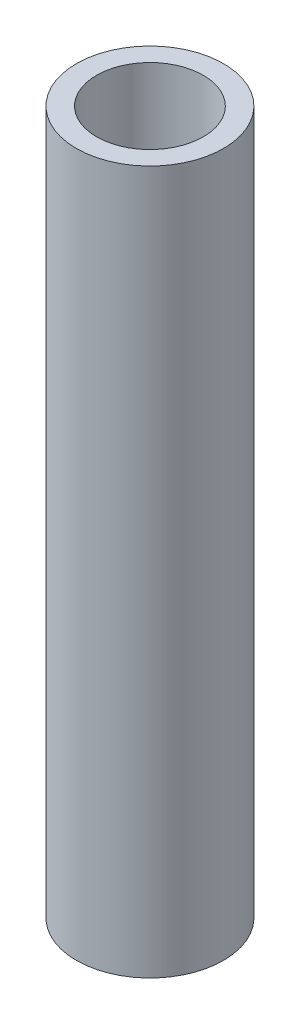
ISO-10303-21;
HEADER;
FILE_DESCRIPTION(('STEP AP214'),'2;1');
FILE_NAME('part.step','',(''),(''),'','','');
FILE_SCHEMA(('AUTOMOTIVE_DESIGN { 1 0 10303 214 1 1 1 1 }'));
ENDSEC;
DATA;
#1=APPLICATION_CONTEXT('core data for automotive mechanical design processes');
#2=APPLICATION_PROTOCOL_DEFINITION('international standard','automotive_design',2000,#1);
#3=PRODUCT_CONTEXT('',#1,'mechanical');
#4=PRODUCT('Part','Part','',(#3));
#5=PRODUCT_RELATED_PRODUCT_CATEGORY('part','',(#4));
#6=PRODUCT_DEFINITION_FORMATION('','',#4);
#7=PRODUCT_DEFINITION_CONTEXT('part definition',#1,'design');
#8=PRODUCT_DEFINITION('design','',#6,#7);
#9=PRODUCT_DEFINITION_SHAPE('','',#8);
#10=(LENGTH_UNIT() NAMED_UNIT(*) SI_UNIT(.MILLI.,.METRE.));
#11=(NAMED_UNIT(*) PLANE_ANGLE_UNIT() SI_UNIT($,.RADIAN.));
#12=(NAMED_UNIT(*) SI_UNIT($,.STERADIAN.) SOLID_ANGLE_UNIT());
#13=UNCERTAINTY_MEASURE_WITH_UNIT(LENGTH_MEASURE(1.E-05),#10,'distance_accuracy_value','');
#14=(GEOMETRIC_REPRESENTATION_CONTEXT(3) GLOBAL_UNCERTAINTY_ASSIGNED_CONTEXT((#13)) GLOBAL_UNIT_ASSIGNED_CONTEXT((#10,
#11,#12)) REPRESENTATION_CONTEXT('',''));
#15=CARTESIAN_POINT('',(0.,0.,0.));
#16=DIRECTION('',(0.,0.,1.));
#17=DIRECTION('',(1.,0.,0.));
#18=AXIS2_PLACEMENT_3D('',#15,#16,#17);
#19=CARTESIAN_POINT('',(0.,101.5,0.));
#20=DIRECTION('',(0.,1.,0.));
#21=DIRECTION('',(0.,0.,1.));
#22=AXIS2_PLACEMENT_3D('',#19,#20,#21);
#23=PLANE('',#22);
#24=CARTESIAN_POINT('',(0.,101.5,0.));
#25=DIRECTION('',(0.,1.,0.));
#26=DIRECTION('',(0.,0.,1.));
#27=AXIS2_PLACEMENT_3D('',#24,#25,#26);
#28=CIRCLE('',#27,10.615);
#29=CARTESIAN_POINT('',(0.,101.5,10.615));
#30=VERTEX_POINT('',#29);
#31=EDGE_CURVE('E37',#30,#30,#28,.T.);
#32=ORIENTED_EDGE('',*,*,#31,.T.);
#33=EDGE_LOOP('',(#32));
#34=FACE_BOUND('',#33,.T.);
#35=CARTESIAN_POINT('',(0.,101.5,0.));
#36=DIRECTION('',(0.,1.,0.));
#37=DIRECTION('',(0.,0.,1.));
#38=AXIS2_PLACEMENT_3D('',#35,#36,#37);
#39=CIRCLE('',#38,7.7);
#40=CARTESIAN_POINT('',(0.,101.5,7.7));
#41=VERTEX_POINT('',#40);
#42=EDGE_CURVE('E46',#41,#41,#39,.T.);
#43=ORIENTED_EDGE('',*,*,#42,.F.);
#44=EDGE_LOOP('',(#43));
#45=FACE_BOUND('',#44,.T.);
#46=ADVANCED_FACE('F30',(#34,#45),#23,.T.);
#47=CARTESIAN_POINT('',(0.,0.,0.));
#48=DIRECTION('',(0.,1.,0.));
#49=DIRECTION('',(0.,0.,1.));
#50=AXIS2_PLACEMENT_3D('',#47,#48,#49);
#51=PLANE('',#50);
#52=CARTESIAN_POINT('',(0.,0.,0.));
#53=DIRECTION('',(0.,1.,0.));
#54=DIRECTION('',(0.,0.,1.));
#55=AXIS2_PLACEMENT_3D('',#52,#53,#54);
#56=CIRCLE('',#55,10.615);
#57=CARTESIAN_POINT('',(0.,0.,10.615));
#58=VERTEX_POINT('',#57);
#59=EDGE_CURVE('E41',#58,#58,#56,.T.);
#60=ORIENTED_EDGE('',*,*,#59,.F.);
#61=EDGE_LOOP('',(#60));
#62=FACE_BOUND('',#61,.T.);
#63=CARTESIAN_POINT('',(0.,0.,0.));
#64=DIRECTION('',(0.,1.,0.));
#65=DIRECTION('',(0.,0.,1.));
#66=AXIS2_PLACEMENT_3D('',#63,#64,#65);
#67=CIRCLE('',#66,3.);
#68=CARTESIAN_POINT('',(0.,0.,3.));
#69=VERTEX_POINT('',#68);
#70=EDGE_CURVE('E51',#69,#69,#67,.T.);
#71=ORIENTED_EDGE('',*,*,#70,.T.);
#72=EDGE_LOOP('',(#71));
#73=FACE_BOUND('',#72,.T.);
#74=ADVANCED_FACE('F69',(#62,#73),#51,.F.);
#75=CARTESIAN_POINT('',(0.,101.5,0.));
#76=DIRECTION('',(0.,-1.,0.));
#77=DIRECTION('',(0.,0.,-1.));
#78=AXIS2_PLACEMENT_3D('',#75,#76,#77);
#79=CYLINDRICAL_SURFACE('',#78,10.615);
#80=ORIENTED_EDGE('',*,*,#31,.F.);
#81=EDGE_LOOP('',(#80));
#82=FACE_BOUND('',#81,.T.);
#83=ORIENTED_EDGE('',*,*,#59,.T.);
#84=EDGE_LOOP('',(#83));
#85=FACE_BOUND('',#84,.T.);
#86=ADVANCED_FACE('F32',(#82,#85),#79,.T.);
#87=CARTESIAN_POINT('',(0.,101.5,0.));
#88=DIRECTION('',(0.,-1.,0.));
#89=DIRECTION('',(0.,0.,-1.));
#90=AXIS2_PLACEMENT_3D('',#87,#88,#89);
#91=CYLINDRICAL_SURFACE('',#90,7.7);
#92=CARTESIAN_POINT('',(0.,12.91,0.));
#93=DIRECTION('',(0.,1.,0.));
#94=DIRECTION('',(0.,0.,1.));
#95=AXIS2_PLACEMENT_3D('',#92,#93,#94);
#96=CIRCLE('',#95,7.7);
#97=CARTESIAN_POINT('',(0.,12.91,7.7));
#98=VERTEX_POINT('',#97);
#99=EDGE_CURVE('E10',#98,#98,#96,.T.);
#100=ORIENTED_EDGE('',*,*,#99,.F.);
#101=EDGE_LOOP('',(#100));
#102=FACE_BOUND('',#101,.T.);
#103=ORIENTED_EDGE('',*,*,#42,.T.);
#104=EDGE_LOOP('',(#103));
#105=FACE_BOUND('',#104,.T.);
#106=ADVANCED_FACE('F66',(#102,#105),#91,.F.);
#107=CARTESIAN_POINT('',(0.,12.91,0.));
#108=DIRECTION('',(0.,-1.,0.));
#109=DIRECTION('',(0.,0.,-1.));
#110=AXIS2_PLACEMENT_3D('',#107,#108,#109);
#111=CYLINDRICAL_SURFACE('',#110,3.);
#112=CARTESIAN_POINT('',(0.,12.91,0.));
#113=DIRECTION('',(0.,1.,0.));
#114=DIRECTION('',(0.,0.,1.));
#115=AXIS2_PLACEMENT_3D('',#112,#113,#114);
#116=CIRCLE('',#115,3.);
#117=CARTESIAN_POINT('',(0.,12.91,3.));
#118=VERTEX_POINT('',#117);
#119=EDGE_CURVE('E50',#118,#118,#116,.T.);
#120=ORIENTED_EDGE('',*,*,#119,.T.);
#121=EDGE_LOOP('',(#120));
#122=FACE_BOUND('',#121,.T.);
#123=ORIENTED_EDGE('',*,*,#70,.F.);
#124=EDGE_LOOP('',(#123));
#125=FACE_BOUND('',#124,.T.);
#126=ADVANCED_FACE('F57',(#122,#125),#111,.F.);
#127=CARTESIAN_POINT('',(0.,12.91,0.));
#128=DIRECTION('',(0.,1.,0.));
#129=DIRECTION('',(0.,0.,1.));
#130=AXIS2_PLACEMENT_3D('',#127,#128,#129);
#131=PLANE('',#130);
#132=ORIENTED_EDGE('',*,*,#119,.F.);
#133=EDGE_LOOP('',(#132));
#134=FACE_BOUND('',#133,.T.);
#135=ORIENTED_EDGE('',*,*,#99,.T.);
#136=EDGE_LOOP('',(#135));
#137=FACE_BOUND('',#136,.T.);
#138=ADVANCED_FACE('F60',(#134,#137),#131,.T.);
#139=CLOSED_SHELL('',(#46,#74,#86,#106,#126,#138));
#140=MANIFOLD_SOLID_BREP('B2',#139);
#141=ADVANCED_BREP_SHAPE_REPRESENTATION('',(#18,#140),#14);
#142=SHAPE_DEFINITION_REPRESENTATION(#9,#141);
ENDSEC;
END-ISO-10303-21;
